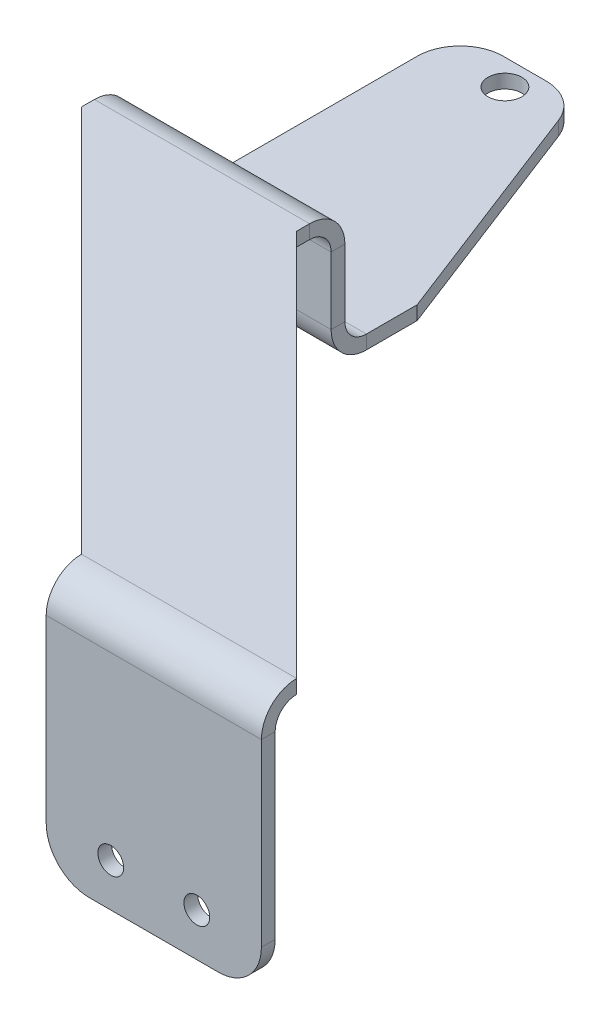
ISO-10303-21;
HEADER;
FILE_DESCRIPTION(('STEP AP214'),'2;1');
FILE_NAME('part.step','',(''),(''),'','','');
FILE_SCHEMA(('AUTOMOTIVE_DESIGN { 1 0 10303 214 1 1 1 1 }'));
ENDSEC;
DATA;
#1=APPLICATION_CONTEXT('core data for automotive mechanical design processes');
#2=APPLICATION_PROTOCOL_DEFINITION('international standard','automotive_design',2000,#1);
#3=PRODUCT_CONTEXT('',#1,'mechanical');
#4=PRODUCT('Part','Part','',(#3));
#5=PRODUCT_RELATED_PRODUCT_CATEGORY('part','',(#4));
#6=PRODUCT_DEFINITION_FORMATION('','',#4);
#7=PRODUCT_DEFINITION_CONTEXT('part definition',#1,'design');
#8=PRODUCT_DEFINITION('design','',#6,#7);
#9=PRODUCT_DEFINITION_SHAPE('','',#8);
#10=(LENGTH_UNIT() NAMED_UNIT(*) SI_UNIT(.MILLI.,.METRE.));
#11=(NAMED_UNIT(*) PLANE_ANGLE_UNIT() SI_UNIT($,.RADIAN.));
#12=(NAMED_UNIT(*) SI_UNIT($,.STERADIAN.) SOLID_ANGLE_UNIT());
#13=UNCERTAINTY_MEASURE_WITH_UNIT(LENGTH_MEASURE(1.E-05),#10,'distance_accuracy_value','');
#14=(GEOMETRIC_REPRESENTATION_CONTEXT(3) GLOBAL_UNCERTAINTY_ASSIGNED_CONTEXT((#13)) GLOBAL_UNIT_ASSIGNED_CONTEXT((#10,
#11,#12)) REPRESENTATION_CONTEXT('',''));
#15=CARTESIAN_POINT('',(0.,0.,0.));
#16=DIRECTION('',(0.,0.,1.));
#17=DIRECTION('',(1.,0.,0.));
#18=AXIS2_PLACEMENT_3D('',#15,#16,#17);
#19=CARTESIAN_POINT('',(-25.2971659919028,18.288,7.66113360323893));
#20=DIRECTION('',(-1.,0.,0.));
#21=DIRECTION('',(0.,0.,1.));
#22=AXIS2_PLACEMENT_3D('',#19,#20,#21);
#23=PLANE('',#22);
#24=DIRECTION('',(0.,1.,0.));
#25=VECTOR('',#24,1.);
#26=CARTESIAN_POINT('',(-25.2971659919028,18.288,7.66113360323893));
#27=LINE('',#26,#25);
#28=CARTESIAN_POINT('',(-25.2971659919028,3.17499999999997,7.66113360323888));
#29=VERTEX_POINT('',#28);
#30=CARTESIAN_POINT('',(-25.2971659919028,13.081,7.66113360323892));
#31=VERTEX_POINT('',#30);
#32=EDGE_CURVE('E381',#29,#31,#27,.T.);
#33=ORIENTED_EDGE('',*,*,#32,.T.);
#34=DIRECTION('',(0.,0.,-1.));
#35=VECTOR('',#34,1.);
#36=CARTESIAN_POINT('',(-25.2971659919028,13.081,7.66113360323892));
#37=LINE('',#36,#35);
#38=CARTESIAN_POINT('',(-25.2971659919028,13.081,5.62913360323892));
#39=VERTEX_POINT('',#38);
#40=EDGE_CURVE('E362',#31,#39,#37,.T.);
#41=ORIENTED_EDGE('',*,*,#40,.T.);
#42=DIRECTION('',(0.,-1.,0.));
#43=VECTOR('',#42,1.);
#44=CARTESIAN_POINT('',(-25.2971659919028,0.,5.62913360323887));
#45=LINE('',#44,#43);
#46=CARTESIAN_POINT('',(-25.2971659919028,3.17499999999998,5.62913360323888));
#47=VERTEX_POINT('',#46);
#48=EDGE_CURVE('E386',#47,#39,#45,.F.);
#49=ORIENTED_EDGE('',*,*,#48,.F.);
#50=DIRECTION('',(0.,0.,1.));
#51=VECTOR('',#50,1.);
#52=CARTESIAN_POINT('',(-25.2971659919028,3.17499999999999,7.66113360323893));
#53=LINE('',#52,#51);
#54=EDGE_CURVE('E376',#47,#29,#53,.T.);
#55=ORIENTED_EDGE('',*,*,#54,.T.);
#56=EDGE_LOOP('',(#33,#41,#49,#55));
#57=FACE_BOUND('',#56,.T.);
#58=ADVANCED_FACE('F97',(#57),#23,.T.);
#59=CARTESIAN_POINT('',(0.,0.,7.66113360323887));
#60=DIRECTION('',(0.,0.,1.));
#61=DIRECTION('',(0.,-1.,0.));
#62=AXIS2_PLACEMENT_3D('',#59,#60,#61);
#63=PLANE('',#62);
#64=DIRECTION('',(0.,-1.,0.));
#65=VECTOR('',#64,1.);
#66=CARTESIAN_POINT('',(6.45283400809717,0.,7.66113360323887));
#67=LINE('',#66,#65);
#68=CARTESIAN_POINT('',(6.45283400809717,13.081,7.66113360323891));
#69=VERTEX_POINT('',#68);
#70=CARTESIAN_POINT('',(6.45283400809717,3.17499999999999,7.66113360323888));
#71=VERTEX_POINT('',#70);
#72=EDGE_CURVE('E378',#69,#71,#67,.T.);
#73=ORIENTED_EDGE('',*,*,#72,.F.);
#74=DIRECTION('',(-1.,0.,0.));
#75=VECTOR('',#74,1.);
#76=CARTESIAN_POINT('',(-25.2971659919028,13.081,7.66113360323892));
#77=LINE('',#76,#75);
#78=EDGE_CURVE('E368',#31,#69,#77,.F.);
#79=ORIENTED_EDGE('',*,*,#78,.F.);
#80=ORIENTED_EDGE('',*,*,#32,.F.);
#81=DIRECTION('',(1.,0.,0.));
#82=VECTOR('',#81,1.);
#83=CARTESIAN_POINT('',(0.,3.17499999999999,7.66113360323888));
#84=LINE('',#83,#82);
#85=EDGE_CURVE('E389',#29,#71,#84,.T.);
#86=ORIENTED_EDGE('',*,*,#85,.T.);
#87=EDGE_LOOP('',(#73,#79,#80,#86));
#88=FACE_BOUND('',#87,.T.);
#89=ADVANCED_FACE('F528',(#88),#63,.T.);
#90=CARTESIAN_POINT('',(0.,0.,5.62913360323887));
#91=DIRECTION('',(0.,0.,1.));
#92=DIRECTION('',(0.,-1.,0.));
#93=AXIS2_PLACEMENT_3D('',#90,#91,#92);
#94=PLANE('',#93);
#95=DIRECTION('',(-1.,0.,0.));
#96=VECTOR('',#95,1.);
#97=CARTESIAN_POINT('',(-25.2971659919028,13.081,5.62913360323892));
#98=LINE('',#97,#96);
#99=CARTESIAN_POINT('',(6.45283400809717,13.081,5.62913360323892));
#100=VERTEX_POINT('',#99);
#101=EDGE_CURVE('E356',#39,#100,#98,.F.);
#102=ORIENTED_EDGE('',*,*,#101,.T.);
#103=DIRECTION('',(0.,1.,0.));
#104=VECTOR('',#103,1.);
#105=CARTESIAN_POINT('',(6.45283400809717,0.,5.62913360323887));
#106=LINE('',#105,#104);
#107=CARTESIAN_POINT('',(6.45283400809717,3.17499999999998,5.62913360323888));
#108=VERTEX_POINT('',#107);
#109=EDGE_CURVE('E384',#100,#108,#106,.F.);
#110=ORIENTED_EDGE('',*,*,#109,.T.);
#111=DIRECTION('',(-1.,0.,0.));
#112=VECTOR('',#111,1.);
#113=CARTESIAN_POINT('',(-25.2971659919028,3.17499999999999,5.62913360323888));
#114=LINE('',#113,#112);
#115=EDGE_CURVE('E395',#47,#108,#114,.F.);
#116=ORIENTED_EDGE('',*,*,#115,.F.);
#117=ORIENTED_EDGE('',*,*,#48,.T.);
#118=EDGE_LOOP('',(#102,#110,#116,#117));
#119=FACE_BOUND('',#118,.T.);
#120=ADVANCED_FACE('F616',(#119),#94,.F.);
#121=CARTESIAN_POINT('',(0.,-2.032,0.));
#122=DIRECTION('',(0.,1.,0.));
#123=DIRECTION('',(0.,0.,1.));
#124=AXIS2_PLACEMENT_3D('',#121,#122,#123);
#125=PLANE('',#124);
#126=CARTESIAN_POINT('',(-14.8971659919028,-2.032,-39.3288663967611));
#127=DIRECTION('',(0.,1.,0.));
#128=DIRECTION('',(0.,0.,1.));
#129=AXIS2_PLACEMENT_3D('',#126,#127,#128);
#130=CIRCLE('',#129,2.5);
#131=CARTESIAN_POINT('',(-14.8971659919028,-2.032,-36.8288663967611));
#132=VERTEX_POINT('',#131);
#133=EDGE_CURVE('E441',#132,#132,#130,.T.);
#134=ORIENTED_EDGE('',*,*,#133,.T.);
#135=EDGE_LOOP('',(#134));
#136=FACE_BOUND('',#135,.T.);
#137=CARTESIAN_POINT('',(-14.8971659919028,-2.032,-1.32886639676113));
#138=DIRECTION('',(0.,1.,0.));
#139=DIRECTION('',(0.,0.,1.));
#140=AXIS2_PLACEMENT_3D('',#137,#138,#139);
#141=CIRCLE('',#140,2.5);
#142=CARTESIAN_POINT('',(-14.8971659919028,-2.032,1.17113360323887));
#143=VERTEX_POINT('',#142);
#144=EDGE_CURVE('E435',#143,#143,#141,.T.);
#145=ORIENTED_EDGE('',*,*,#144,.T.);
#146=EDGE_LOOP('',(#145));
#147=FACE_BOUND('',#146,.T.);
#148=DIRECTION('',(-1.,0.,0.));
#149=VECTOR('',#148,1.);
#150=CARTESIAN_POINT('',(-25.2971659919028,-2.032,-43.1388663967611));
#151=LINE('',#150,#149);
#152=CARTESIAN_POINT('',(-12.6301202704523,-2.032,-43.1388663967611));
#153=VERTEX_POINT('',#152);
#154=CARTESIAN_POINT('',(-18.9471659919028,-2.032,-43.1388663967611));
#155=VERTEX_POINT('',#154);
#156=EDGE_CURVE('E447',#153,#155,#151,.T.);
#157=ORIENTED_EDGE('',*,*,#156,.F.);
#158=CARTESIAN_POINT('',(-12.6301202704523,-2.032,-36.7888663967611));
#159=DIRECTION('',(0.,1.,0.));
#160=DIRECTION('',(0.,0.,1.));
#161=AXIS2_PLACEMENT_3D('',#158,#159,#160);
#162=CIRCLE('',#161,6.35);
#163=CARTESIAN_POINT('',(-6.70734558879039,-2.032,-39.0786786314793));
#164=VERTEX_POINT('',#163);
#165=EDGE_CURVE('E105',#153,#164,#162,.F.);
#166=ORIENTED_EDGE('',*,*,#165,.T.);
#167=DIRECTION('',(0.360600351924129,0.,0.932720422308954));
#168=VECTOR('',#167,1.);
#169=CARTESIAN_POINT('',(7.30852399538076,-2.032,-2.82555872236201));
#170=LINE('',#169,#168);
#171=CARTESIAN_POINT('',(6.45283400809717,-2.032,-5.03886639676113));
#172=VERTEX_POINT('',#171);
#173=EDGE_CURVE('E430',#164,#172,#170,.T.);
#174=ORIENTED_EDGE('',*,*,#173,.T.);
#175=DIRECTION('',(0.,0.,1.));
#176=VECTOR('',#175,1.);
#177=CARTESIAN_POINT('',(6.45283400809717,-2.032,0.));
#178=LINE('',#177,#176);
#179=CARTESIAN_POINT('',(6.45283400809717,-2.03200000000001,2.45413360323888));
#180=VERTEX_POINT('',#179);
#181=EDGE_CURVE('E432',#172,#180,#178,.T.);
#182=ORIENTED_EDGE('',*,*,#181,.T.);
#183=DIRECTION('',(1.,0.,0.));
#184=VECTOR('',#183,1.);
#185=CARTESIAN_POINT('',(6.45283400809717,-2.03200000000001,2.45413360323888));
#186=LINE('',#185,#184);
#187=CARTESIAN_POINT('',(-25.2971659919028,-2.032,2.45413360323888));
#188=VERTEX_POINT('',#187);
#189=EDGE_CURVE('E400',#180,#188,#186,.F.);
#190=ORIENTED_EDGE('',*,*,#189,.T.);
#191=DIRECTION('',(0.,0.,1.));
#192=VECTOR('',#191,1.);
#193=CARTESIAN_POINT('',(-25.2971659919028,-2.032,-43.1388663967611));
#194=LINE('',#193,#192);
#195=CARTESIAN_POINT('',(-25.2971659919028,-2.032,-36.7888663967611));
#196=VERTEX_POINT('',#195);
#197=EDGE_CURVE('E449',#196,#188,#194,.T.);
#198=ORIENTED_EDGE('',*,*,#197,.F.);
#199=CARTESIAN_POINT('',(-18.9471659919028,-2.032,-36.7888663967611));
#200=DIRECTION('',(0.,1.,0.));
#201=DIRECTION('',(0.,0.,1.));
#202=AXIS2_PLACEMENT_3D('',#199,#200,#201);
#203=CIRCLE('',#202,6.35);
#204=EDGE_CURVE('E117',#196,#155,#203,.F.);
#205=ORIENTED_EDGE('',*,*,#204,.T.);
#206=EDGE_LOOP('',(#157,#166,#174,#182,#190,#198,#205));
#207=FACE_BOUND('',#206,.T.);
#208=ADVANCED_FACE('F492',(#136,#147,#207),#125,.F.);
#209=CARTESIAN_POINT('',(0.,0.,0.));
#210=DIRECTION('',(0.,1.,0.));
#211=DIRECTION('',(0.,0.,1.));
#212=AXIS2_PLACEMENT_3D('',#209,#210,#211);
#213=PLANE('',#212);
#214=CARTESIAN_POINT('',(-14.8971659919028,0.,-1.32886639676113));
#215=DIRECTION('',(0.,1.,0.));
#216=DIRECTION('',(0.,0.,1.));
#217=AXIS2_PLACEMENT_3D('',#214,#215,#216);
#218=CIRCLE('',#217,2.5);
#219=CARTESIAN_POINT('',(-14.8971659919028,0.,1.17113360323887));
#220=VERTEX_POINT('',#219);
#221=EDGE_CURVE('E434',#220,#220,#218,.T.);
#222=ORIENTED_EDGE('',*,*,#221,.F.);
#223=EDGE_LOOP('',(#222));
#224=FACE_BOUND('',#223,.T.);
#225=CARTESIAN_POINT('',(-14.8971659919028,0.,-39.3288663967611));
#226=DIRECTION('',(0.,1.,0.));
#227=DIRECTION('',(0.,0.,1.));
#228=AXIS2_PLACEMENT_3D('',#225,#226,#227);
#229=CIRCLE('',#228,2.5);
#230=CARTESIAN_POINT('',(-14.8971659919028,0.,-36.8288663967611));
#231=VERTEX_POINT('',#230);
#232=EDGE_CURVE('E438',#231,#231,#229,.T.);
#233=ORIENTED_EDGE('',*,*,#232,.F.);
#234=EDGE_LOOP('',(#233));
#235=FACE_BOUND('',#234,.T.);
#236=DIRECTION('',(0.360600351924129,0.,0.932720422308954));
#237=VECTOR('',#236,1.);
#238=CARTESIAN_POINT('',(6.45283400809717,0.,-5.03886639676113));
#239=LINE('',#238,#237);
#240=CARTESIAN_POINT('',(-6.7073455887904,0.,-39.0786786314793));
#241=VERTEX_POINT('',#240);
#242=CARTESIAN_POINT('',(6.45283400809717,0.,-5.03886639676113));
#243=VERTEX_POINT('',#242);
#244=EDGE_CURVE('E425',#241,#243,#239,.T.);
#245=ORIENTED_EDGE('',*,*,#244,.F.);
#246=CARTESIAN_POINT('',(-12.6301202704523,0.,-36.7888663967611));
#247=DIRECTION('',(0.,1.,0.));
#248=DIRECTION('',(0.,0.,1.));
#249=AXIS2_PLACEMENT_3D('',#246,#247,#248);
#250=CIRCLE('',#249,6.35);
#251=CARTESIAN_POINT('',(-12.6301202704523,0.,-43.1388663967611));
#252=VERTEX_POINT('',#251);
#253=EDGE_CURVE('E483',#241,#252,#250,.T.);
#254=ORIENTED_EDGE('',*,*,#253,.T.);
#255=DIRECTION('',(-1.,0.,0.));
#256=VECTOR('',#255,1.);
#257=CARTESIAN_POINT('',(-25.2971659919028,0.,-43.1388663967611));
#258=LINE('',#257,#256);
#259=CARTESIAN_POINT('',(-18.9471659919028,0.,-43.1388663967611));
#260=VERTEX_POINT('',#259);
#261=EDGE_CURVE('E444',#252,#260,#258,.T.);
#262=ORIENTED_EDGE('',*,*,#261,.T.);
#263=CARTESIAN_POINT('',(-18.9471659919028,0.,-36.7888663967611));
#264=DIRECTION('',(0.,1.,0.));
#265=DIRECTION('',(0.,0.,1.));
#266=AXIS2_PLACEMENT_3D('',#263,#264,#265);
#267=CIRCLE('',#266,6.35);
#268=CARTESIAN_POINT('',(-25.2971659919028,0.,-36.7888663967611));
#269=VERTEX_POINT('',#268);
#270=EDGE_CURVE('E481',#260,#269,#267,.T.);
#271=ORIENTED_EDGE('',*,*,#270,.T.);
#272=DIRECTION('',(0.,0.,1.));
#273=VECTOR('',#272,1.);
#274=CARTESIAN_POINT('',(-25.2971659919028,0.,-43.1388663967611));
#275=LINE('',#274,#273);
#276=CARTESIAN_POINT('',(-25.2971659919028,0.,2.45413360323888));
#277=VERTEX_POINT('',#276);
#278=EDGE_CURVE('E450',#269,#277,#275,.T.);
#279=ORIENTED_EDGE('',*,*,#278,.T.);
#280=DIRECTION('',(1.,0.,0.));
#281=VECTOR('',#280,1.);
#282=CARTESIAN_POINT('',(6.45283400809717,0.,2.45413360323888));
#283=LINE('',#282,#281);
#284=CARTESIAN_POINT('',(6.45283400809717,0.,2.45413360323888));
#285=VERTEX_POINT('',#284);
#286=EDGE_CURVE('E413',#285,#277,#283,.F.);
#287=ORIENTED_EDGE('',*,*,#286,.F.);
#288=DIRECTION('',(0.,0.,1.));
#289=VECTOR('',#288,1.);
#290=CARTESIAN_POINT('',(6.45283400809717,0.,-5.03886639676113));
#291=LINE('',#290,#289);
#292=EDGE_CURVE('E421',#243,#285,#291,.T.);
#293=ORIENTED_EDGE('',*,*,#292,.F.);
#294=EDGE_LOOP('',(#245,#254,#262,#271,#279,#287,#293));
#295=FACE_BOUND('',#294,.T.);
#296=ADVANCED_FACE('F504',(#224,#235,#295),#213,.T.);
#297=CARTESIAN_POINT('',(6.45283400809717,-2.54,-5.03886639676113));
#298=DIRECTION('',(-1.,0.,0.));
#299=DIRECTION('',(0.,0.,1.));
#300=AXIS2_PLACEMENT_3D('',#297,#298,#299);
#301=PLANE('',#300);
#302=DIRECTION('',(0.,-1.,0.));
#303=VECTOR('',#302,1.);
#304=CARTESIAN_POINT('',(6.45283400809717,0.,2.45413360323888));
#305=LINE('',#304,#303);
#306=EDGE_CURVE('E407',#285,#180,#305,.T.);
#307=ORIENTED_EDGE('',*,*,#306,.T.);
#308=ORIENTED_EDGE('',*,*,#181,.F.);
#309=DIRECTION('',(0.,1.,0.));
#310=VECTOR('',#309,1.);
#311=CARTESIAN_POINT('',(6.45283400809717,-2.54,-5.03886639676113));
#312=LINE('',#311,#310);
#313=EDGE_CURVE('E427',#172,#243,#312,.T.);
#314=ORIENTED_EDGE('',*,*,#313,.T.);
#315=ORIENTED_EDGE('',*,*,#292,.T.);
#316=EDGE_LOOP('',(#307,#308,#314,#315));
#317=FACE_BOUND('',#316,.T.);
#318=ADVANCED_FACE('F637',(#317),#301,.F.);
#319=CARTESIAN_POINT('',(-25.2971659919028,-2.032,-43.1388663967611));
#320=DIRECTION('',(-1.,0.,0.));
#321=DIRECTION('',(0.,0.,1.));
#322=AXIS2_PLACEMENT_3D('',#319,#320,#321);
#323=PLANE('',#322);
#324=ORIENTED_EDGE('',*,*,#278,.F.);
#325=DIRECTION('',(0.,1.,0.));
#326=VECTOR('',#325,1.);
#327=CARTESIAN_POINT('',(-25.2971659919028,-2.032,-36.7888663967611));
#328=LINE('',#327,#326);
#329=EDGE_CURVE('E13',#269,#196,#328,.F.);
#330=ORIENTED_EDGE('',*,*,#329,.T.);
#331=ORIENTED_EDGE('',*,*,#197,.T.);
#332=DIRECTION('',(0.,-1.,0.));
#333=VECTOR('',#332,1.);
#334=CARTESIAN_POINT('',(-25.2971659919028,0.,2.45413360323888));
#335=LINE('',#334,#333);
#336=EDGE_CURVE('E418',#277,#188,#335,.T.);
#337=ORIENTED_EDGE('',*,*,#336,.F.);
#338=EDGE_LOOP('',(#324,#330,#331,#337));
#339=FACE_BOUND('',#338,.T.);
#340=ADVANCED_FACE('F512',(#339),#323,.T.);
#341=CARTESIAN_POINT('',(-25.2971659919028,-2.032,-43.1388663967611));
#342=DIRECTION('',(0.,0.,-1.));
#343=DIRECTION('',(-1.,0.,0.));
#344=AXIS2_PLACEMENT_3D('',#341,#342,#343);
#345=PLANE('',#344);
#346=ORIENTED_EDGE('',*,*,#261,.F.);
#347=DIRECTION('',(0.,1.,0.));
#348=VECTOR('',#347,1.);
#349=CARTESIAN_POINT('',(-12.6301202704523,-2.032,-43.1388663967611));
#350=LINE('',#349,#348);
#351=EDGE_CURVE('E488',#252,#153,#350,.F.);
#352=ORIENTED_EDGE('',*,*,#351,.T.);
#353=ORIENTED_EDGE('',*,*,#156,.T.);
#354=DIRECTION('',(0.,1.,0.));
#355=VECTOR('',#354,1.);
#356=CARTESIAN_POINT('',(-18.9471659919028,-2.032,-43.1388663967611));
#357=LINE('',#356,#355);
#358=EDGE_CURVE('E485',#155,#260,#357,.T.);
#359=ORIENTED_EDGE('',*,*,#358,.T.);
#360=EDGE_LOOP('',(#346,#352,#353,#359));
#361=FACE_BOUND('',#360,.T.);
#362=ADVANCED_FACE('F507',(#361),#345,.T.);
#363=CARTESIAN_POINT('',(-14.8971659919028,-2.032,-39.3288663967611));
#364=DIRECTION('',(0.,1.,0.));
#365=DIRECTION('',(0.,0.,1.));
#366=AXIS2_PLACEMENT_3D('',#363,#364,#365);
#367=CYLINDRICAL_SURFACE('',#366,2.5);
#368=ORIENTED_EDGE('',*,*,#133,.F.);
#369=EDGE_LOOP('',(#368));
#370=FACE_BOUND('',#369,.T.);
#371=ORIENTED_EDGE('',*,*,#232,.T.);
#372=EDGE_LOOP('',(#371));
#373=FACE_BOUND('',#372,.T.);
#374=ADVANCED_FACE('F643',(#370,#373),#367,.F.);
#375=CARTESIAN_POINT('',(-14.8971659919028,-2.032,-1.32886639676113));
#376=DIRECTION('',(0.,1.,0.));
#377=DIRECTION('',(0.,0.,1.));
#378=AXIS2_PLACEMENT_3D('',#375,#376,#377);
#379=CYLINDRICAL_SURFACE('',#378,2.5);
#380=ORIENTED_EDGE('',*,*,#144,.F.);
#381=EDGE_LOOP('',(#380));
#382=FACE_BOUND('',#381,.T.);
#383=ORIENTED_EDGE('',*,*,#221,.T.);
#384=EDGE_LOOP('',(#383));
#385=FACE_BOUND('',#384,.T.);
#386=ADVANCED_FACE('F636',(#382,#385),#379,.F.);
#387=CARTESIAN_POINT('',(6.45283400809717,-2.54,-5.03886639676113));
#388=DIRECTION('',(-0.932720422308954,0.,0.360600351924129));
#389=DIRECTION('',(0.360600351924129,0.,0.932720422308954));
#390=AXIS2_PLACEMENT_3D('',#387,#388,#389);
#391=PLANE('',#390);
#392=ORIENTED_EDGE('',*,*,#173,.F.);
#393=DIRECTION('',(0.,1.,0.));
#394=VECTOR('',#393,1.);
#395=CARTESIAN_POINT('',(-6.70734558879039,0.,-39.0786786314793));
#396=LINE('',#395,#394);
#397=EDGE_CURVE('E478',#164,#241,#396,.T.);
#398=ORIENTED_EDGE('',*,*,#397,.T.);
#399=ORIENTED_EDGE('',*,*,#244,.T.);
#400=ORIENTED_EDGE('',*,*,#313,.F.);
#401=EDGE_LOOP('',(#392,#398,#399,#400));
#402=FACE_BOUND('',#401,.T.);
#403=ADVANCED_FACE('F499',(#402),#391,.F.);
#404=CARTESIAN_POINT('',(-25.2971659919028,3.17499999999999,2.45413360323888));
#405=DIRECTION('',(-1.,0.,0.));
#406=DIRECTION('',(0.,0.,1.));
#407=AXIS2_PLACEMENT_3D('',#404,#405,#406);
#408=PLANE('',#407);
#409=ORIENTED_EDGE('',*,*,#54,.F.);
#410=CARTESIAN_POINT('',(-25.2971659919028,3.17499999999999,2.45413360323888));
#411=DIRECTION('',(1.,0.,0.));
#412=DIRECTION('',(0.,0.,-1.));
#413=AXIS2_PLACEMENT_3D('',#410,#411,#412);
#414=CIRCLE('',#413,3.175);
#415=EDGE_CURVE('E410',#277,#47,#414,.F.);
#416=ORIENTED_EDGE('',*,*,#415,.F.);
#417=ORIENTED_EDGE('',*,*,#336,.T.);
#418=CARTESIAN_POINT('',(-25.2971659919028,3.17499999999999,2.45413360323888));
#419=DIRECTION('',(1.,0.,0.));
#420=DIRECTION('',(0.,0.,-1.));
#421=AXIS2_PLACEMENT_3D('',#418,#419,#420);
#422=CIRCLE('',#421,5.207);
#423=EDGE_CURVE('E403',#188,#29,#422,.F.);
#424=ORIENTED_EDGE('',*,*,#423,.T.);
#425=EDGE_LOOP('',(#409,#416,#417,#424));
#426=FACE_BOUND('',#425,.T.);
#427=ADVANCED_FACE('F521',(#426),#408,.T.);
#428=CARTESIAN_POINT('',(6.45283400809717,3.17499999999999,2.45413360323888));
#429=DIRECTION('',(-1.,0.,0.));
#430=DIRECTION('',(0.,0.,1.));
#431=AXIS2_PLACEMENT_3D('',#428,#429,#430);
#432=PLANE('',#431);
#433=CARTESIAN_POINT('',(6.45283400809717,3.17499999999999,2.45413360323888));
#434=DIRECTION('',(1.,0.,0.));
#435=DIRECTION('',(0.,0.,-1.));
#436=AXIS2_PLACEMENT_3D('',#433,#434,#435);
#437=CIRCLE('',#436,3.175);
#438=EDGE_CURVE('E380',#108,#285,#437,.T.);
#439=ORIENTED_EDGE('',*,*,#438,.F.);
#440=DIRECTION('',(0.,0.,1.));
#441=VECTOR('',#440,1.);
#442=CARTESIAN_POINT('',(6.45283400809717,3.17499999999999,5.62913360323888));
#443=LINE('',#442,#441);
#444=EDGE_CURVE('E392',#108,#71,#443,.T.);
#445=ORIENTED_EDGE('',*,*,#444,.T.);
#446=CARTESIAN_POINT('',(6.45283400809717,3.17499999999999,2.45413360323888));
#447=DIRECTION('',(1.,0.,0.));
#448=DIRECTION('',(0.,0.,-1.));
#449=AXIS2_PLACEMENT_3D('',#446,#447,#448);
#450=CIRCLE('',#449,5.207);
#451=EDGE_CURVE('E404',#71,#180,#450,.T.);
#452=ORIENTED_EDGE('',*,*,#451,.T.);
#453=ORIENTED_EDGE('',*,*,#306,.F.);
#454=EDGE_LOOP('',(#439,#445,#452,#453));
#455=FACE_BOUND('',#454,.T.);
#456=ADVANCED_FACE('F625',(#455),#432,.F.);
#457=CARTESIAN_POINT('',(6.45283400809717,3.17499999999999,2.45413360323888));
#458=DIRECTION('',(1.,0.,0.));
#459=DIRECTION('',(0.,0.,1.));
#460=AXIS2_PLACEMENT_3D('',#457,#458,#459);
#461=CYLINDRICAL_SURFACE('',#460,5.207);
#462=ORIENTED_EDGE('',*,*,#189,.F.);
#463=ORIENTED_EDGE('',*,*,#451,.F.);
#464=ORIENTED_EDGE('',*,*,#85,.F.);
#465=ORIENTED_EDGE('',*,*,#423,.F.);
#466=EDGE_LOOP('',(#462,#463,#464,#465));
#467=FACE_BOUND('',#466,.T.);
#468=ADVANCED_FACE('F622',(#467),#461,.T.);
#469=CARTESIAN_POINT('',(6.45283400809717,3.17499999999999,2.45413360323888));
#470=DIRECTION('',(1.,0.,0.));
#471=DIRECTION('',(0.,0.,1.));
#472=AXIS2_PLACEMENT_3D('',#469,#470,#471);
#473=CYLINDRICAL_SURFACE('',#472,3.175);
#474=ORIENTED_EDGE('',*,*,#286,.T.);
#475=ORIENTED_EDGE('',*,*,#415,.T.);
#476=ORIENTED_EDGE('',*,*,#115,.T.);
#477=ORIENTED_EDGE('',*,*,#438,.T.);
#478=EDGE_LOOP('',(#474,#475,#476,#477));
#479=FACE_BOUND('',#478,.T.);
#480=ADVANCED_FACE('F517',(#479),#473,.F.);
#481=CARTESIAN_POINT('',(6.45283400809717,0.,7.66113360323887));
#482=DIRECTION('',(1.,0.,0.));
#483=DIRECTION('',(0.,1.,0.));
#484=AXIS2_PLACEMENT_3D('',#481,#482,#483);
#485=PLANE('',#484);
#486=DIRECTION('',(0.,0.,-1.));
#487=VECTOR('',#486,1.);
#488=CARTESIAN_POINT('',(6.45283400809717,13.081,7.66113360323892));
#489=LINE('',#488,#487);
#490=EDGE_CURVE('E373',#69,#100,#489,.T.);
#491=ORIENTED_EDGE('',*,*,#490,.F.);
#492=ORIENTED_EDGE('',*,*,#72,.T.);
#493=ORIENTED_EDGE('',*,*,#444,.F.);
#494=ORIENTED_EDGE('',*,*,#109,.F.);
#495=EDGE_LOOP('',(#491,#492,#493,#494));
#496=FACE_BOUND('',#495,.T.);
#497=ADVANCED_FACE('F620',(#496),#485,.T.);
#498=CARTESIAN_POINT('',(6.45283400809717,13.081,10.8361336032389));
#499=DIRECTION('',(1.,0.,0.));
#500=DIRECTION('',(0.,1.,0.));
#501=AXIS2_PLACEMENT_3D('',#498,#499,#500);
#502=PLANE('',#501);
#503=DIRECTION('',(0.,-1.,0.));
#504=VECTOR('',#503,1.);
#505=CARTESIAN_POINT('',(6.45283400809717,18.288,10.8361336032389));
#506=LINE('',#505,#504);
#507=CARTESIAN_POINT('',(6.45283400809717,16.256,10.8361336032389));
#508=VERTEX_POINT('',#507);
#509=CARTESIAN_POINT('',(6.45283400809717,18.288,10.8361336032389));
#510=VERTEX_POINT('',#509);
#511=EDGE_CURVE('E329',#508,#510,#506,.F.);
#512=ORIENTED_EDGE('',*,*,#511,.F.);
#513=CARTESIAN_POINT('',(6.45283400809717,13.081,10.8361336032389));
#514=DIRECTION('',(-1.,0.,0.));
#515=DIRECTION('',(0.,-1.,0.));
#516=AXIS2_PLACEMENT_3D('',#513,#514,#515);
#517=CIRCLE('',#516,3.175);
#518=EDGE_CURVE('E365',#69,#508,#517,.F.);
#519=ORIENTED_EDGE('',*,*,#518,.F.);
#520=ORIENTED_EDGE('',*,*,#490,.T.);
#521=CARTESIAN_POINT('',(6.45283400809717,13.081,10.8361336032389));
#522=DIRECTION('',(-1.,0.,0.));
#523=DIRECTION('',(0.,-1.,0.));
#524=AXIS2_PLACEMENT_3D('',#521,#522,#523);
#525=CIRCLE('',#524,5.207);
#526=EDGE_CURVE('E358',#100,#510,#525,.F.);
#527=ORIENTED_EDGE('',*,*,#526,.T.);
#528=EDGE_LOOP('',(#512,#519,#520,#527));
#529=FACE_BOUND('',#528,.T.);
#530=ADVANCED_FACE('F535',(#529),#502,.T.);
#531=CARTESIAN_POINT('',(-25.2971659919028,13.081,10.8361336032389));
#532=DIRECTION('',(1.,0.,0.));
#533=DIRECTION('',(0.,1.,0.));
#534=AXIS2_PLACEMENT_3D('',#531,#532,#533);
#535=PLANE('',#534);
#536=CARTESIAN_POINT('',(-25.2971659919028,13.081,10.8361336032389));
#537=DIRECTION('',(-1.,0.,0.));
#538=DIRECTION('',(0.,-1.,0.));
#539=AXIS2_PLACEMENT_3D('',#536,#537,#538);
#540=CIRCLE('',#539,3.175);
#541=CARTESIAN_POINT('',(-25.2971659919028,16.256,10.8361336032389));
#542=VERTEX_POINT('',#541);
#543=EDGE_CURVE('E334',#542,#31,#540,.T.);
#544=ORIENTED_EDGE('',*,*,#543,.F.);
#545=DIRECTION('',(0.,-1.,0.));
#546=VECTOR('',#545,1.);
#547=CARTESIAN_POINT('',(-25.2971659919028,16.256,10.8361336032389));
#548=LINE('',#547,#546);
#549=CARTESIAN_POINT('',(-25.2971659919028,18.288,10.8361336032389));
#550=VERTEX_POINT('',#549);
#551=EDGE_CURVE('E349',#542,#550,#548,.F.);
#552=ORIENTED_EDGE('',*,*,#551,.T.);
#553=CARTESIAN_POINT('',(-25.2971659919028,13.081,10.8361336032389));
#554=DIRECTION('',(-1.,0.,0.));
#555=DIRECTION('',(0.,-1.,0.));
#556=AXIS2_PLACEMENT_3D('',#553,#554,#555);
#557=CIRCLE('',#556,5.207);
#558=EDGE_CURVE('E359',#550,#39,#557,.T.);
#559=ORIENTED_EDGE('',*,*,#558,.T.);
#560=ORIENTED_EDGE('',*,*,#40,.F.);
#561=EDGE_LOOP('',(#544,#552,#559,#560));
#562=FACE_BOUND('',#561,.T.);
#563=ADVANCED_FACE('F557',(#562),#535,.F.);
#564=CARTESIAN_POINT('',(-25.2971659919028,13.081,10.8361336032389));
#565=DIRECTION('',(-1.,0.,0.));
#566=DIRECTION('',(0.,1.,0.));
#567=AXIS2_PLACEMENT_3D('',#564,#565,#566);
#568=CYLINDRICAL_SURFACE('',#567,5.207);
#569=ORIENTED_EDGE('',*,*,#101,.F.);
#570=ORIENTED_EDGE('',*,*,#558,.F.);
#571=DIRECTION('',(-1.,0.,0.));
#572=VECTOR('',#571,1.);
#573=CARTESIAN_POINT('',(6.45283400809717,18.288,10.8361336032389));
#574=LINE('',#573,#572);
#575=EDGE_CURVE('E347',#550,#510,#574,.F.);
#576=ORIENTED_EDGE('',*,*,#575,.T.);
#577=ORIENTED_EDGE('',*,*,#526,.F.);
#578=EDGE_LOOP('',(#569,#570,#576,#577));
#579=FACE_BOUND('',#578,.T.);
#580=ADVANCED_FACE('F875',(#579),#568,.T.);
#581=CARTESIAN_POINT('',(-25.2971659919028,13.081,10.8361336032389));
#582=DIRECTION('',(-1.,0.,0.));
#583=DIRECTION('',(0.,1.,0.));
#584=AXIS2_PLACEMENT_3D('',#581,#582,#583);
#585=CYLINDRICAL_SURFACE('',#584,3.175);
#586=ORIENTED_EDGE('',*,*,#78,.T.);
#587=ORIENTED_EDGE('',*,*,#518,.T.);
#588=DIRECTION('',(-1.,0.,0.));
#589=VECTOR('',#588,1.);
#590=CARTESIAN_POINT('',(6.45283400809717,16.256,10.8361336032389));
#591=LINE('',#590,#589);
#592=EDGE_CURVE('E352',#508,#542,#591,.T.);
#593=ORIENTED_EDGE('',*,*,#592,.T.);
#594=ORIENTED_EDGE('',*,*,#543,.T.);
#595=EDGE_LOOP('',(#586,#587,#593,#594));
#596=FACE_BOUND('',#595,.T.);
#597=ADVANCED_FACE('F531',(#596),#585,.F.);
#598=CARTESIAN_POINT('',(-25.2971659919028,18.288,12.7411336032389));
#599=DIRECTION('',(1.,0.,0.));
#600=DIRECTION('',(0.,0.,-1.));
#601=AXIS2_PLACEMENT_3D('',#598,#599,#600);
#602=PLANE('',#601);
#603=ORIENTED_EDGE('',*,*,#551,.F.);
#604=DIRECTION('',(0.,0.,-1.));
#605=VECTOR('',#604,1.);
#606=CARTESIAN_POINT('',(-25.2971659919028,16.256,12.7411336032389));
#607=LINE('',#606,#605);
#608=CARTESIAN_POINT('',(-25.2971659919028,16.256,12.7411336032389));
#609=VERTEX_POINT('',#608);
#610=EDGE_CURVE('E345',#542,#609,#607,.F.);
#611=ORIENTED_EDGE('',*,*,#610,.T.);
#612=DIRECTION('',(0.,-1.,0.));
#613=VECTOR('',#612,1.);
#614=CARTESIAN_POINT('',(-25.2971659919028,18.288,12.7411336032389));
#615=LINE('',#614,#613);
#616=CARTESIAN_POINT('',(-25.2971659919028,18.288,12.7411336032389));
#617=VERTEX_POINT('',#616);
#618=EDGE_CURVE('E331',#617,#609,#615,.T.);
#619=ORIENTED_EDGE('',*,*,#618,.F.);
#620=DIRECTION('',(0.,0.,1.));
#621=VECTOR('',#620,1.);
#622=CARTESIAN_POINT('',(-25.2971659919028,18.288,0.));
#623=LINE('',#622,#621);
#624=EDGE_CURVE('E340',#550,#617,#623,.T.);
#625=ORIENTED_EDGE('',*,*,#624,.F.);
#626=EDGE_LOOP('',(#603,#611,#619,#625));
#627=FACE_BOUND('',#626,.T.);
#628=ADVANCED_FACE('F559',(#627),#602,.F.);
#629=CARTESIAN_POINT('',(6.45283400809717,18.288,7.66113360323893));
#630=DIRECTION('',(-1.,0.,0.));
#631=DIRECTION('',(0.,-1.,0.));
#632=AXIS2_PLACEMENT_3D('',#629,#630,#631);
#633=PLANE('',#632);
#634=ORIENTED_EDGE('',*,*,#511,.T.);
#635=DIRECTION('',(0.,0.,-1.));
#636=VECTOR('',#635,1.);
#637=CARTESIAN_POINT('',(6.45283400809717,18.288,0.));
#638=LINE('',#637,#636);
#639=CARTESIAN_POINT('',(6.45283400809717,18.288,12.7411336032389));
#640=VERTEX_POINT('',#639);
#641=EDGE_CURVE('E337',#640,#510,#638,.T.);
#642=ORIENTED_EDGE('',*,*,#641,.F.);
#643=DIRECTION('',(0.,-1.,0.));
#644=VECTOR('',#643,1.);
#645=CARTESIAN_POINT('',(6.45283400809717,18.288,12.7411336032389));
#646=LINE('',#645,#644);
#647=CARTESIAN_POINT('',(6.45283400809717,16.256,12.7411336032389));
#648=VERTEX_POINT('',#647);
#649=EDGE_CURVE('E335',#640,#648,#646,.T.);
#650=ORIENTED_EDGE('',*,*,#649,.T.);
#651=DIRECTION('',(0.,0.,1.));
#652=VECTOR('',#651,1.);
#653=CARTESIAN_POINT('',(6.45283400809717,16.256,7.66113360323893));
#654=LINE('',#653,#652);
#655=EDGE_CURVE('E342',#648,#508,#654,.F.);
#656=ORIENTED_EDGE('',*,*,#655,.T.);
#657=EDGE_LOOP('',(#634,#642,#650,#656));
#658=FACE_BOUND('',#657,.T.);
#659=ADVANCED_FACE('F538',(#658),#633,.F.);
#660=CARTESIAN_POINT('',(0.,18.288,0.));
#661=DIRECTION('',(0.,-1.,0.));
#662=DIRECTION('',(0.,0.,-1.));
#663=AXIS2_PLACEMENT_3D('',#660,#661,#662);
#664=PLANE('',#663);
#665=ORIENTED_EDGE('',*,*,#575,.F.);
#666=ORIENTED_EDGE('',*,*,#624,.T.);
#667=DIRECTION('',(0.707106781186547,0.,0.707106781186548));
#668=VECTOR('',#667,1.);
#669=CARTESIAN_POINT('',(-25.2971659919028,18.288,12.7411336032389));
#670=LINE('',#669,#668);
#671=CARTESIAN_POINT('',(31.8528340080972,18.288,69.8911336032389));
#672=VERTEX_POINT('',#671);
#673=EDGE_CURVE('E306',#617,#672,#670,.T.);
#674=ORIENTED_EDGE('',*,*,#673,.T.);
#675=DIRECTION('',(1.,0.,0.));
#676=VECTOR('',#675,1.);
#677=CARTESIAN_POINT('',(31.8528340080972,18.288,69.8911336032389));
#678=LINE('',#677,#676);
#679=CARTESIAN_POINT('',(63.6028340080972,18.288,69.8911336032389));
#680=VERTEX_POINT('',#679);
#681=EDGE_CURVE('E259',#672,#680,#678,.T.);
#682=ORIENTED_EDGE('',*,*,#681,.T.);
#683=DIRECTION('',(-0.707106781186547,0.,-0.707106781186548));
#684=VECTOR('',#683,1.);
#685=CARTESIAN_POINT('',(6.45283400809717,18.288,12.7411336032389));
#686=LINE('',#685,#684);
#687=EDGE_CURVE('E315',#680,#640,#686,.T.);
#688=ORIENTED_EDGE('',*,*,#687,.T.);
#689=ORIENTED_EDGE('',*,*,#641,.T.);
#690=EDGE_LOOP('',(#665,#666,#674,#682,#688,#689));
#691=FACE_BOUND('',#690,.T.);
#692=ADVANCED_FACE('F543',(#691),#664,.F.);
#693=CARTESIAN_POINT('',(0.,16.256,0.));
#694=DIRECTION('',(0.,-1.,0.));
#695=DIRECTION('',(0.,0.,-1.));
#696=AXIS2_PLACEMENT_3D('',#693,#694,#695);
#697=PLANE('',#696);
#698=ORIENTED_EDGE('',*,*,#610,.F.);
#699=ORIENTED_EDGE('',*,*,#592,.F.);
#700=ORIENTED_EDGE('',*,*,#655,.F.);
#701=DIRECTION('',(-0.707106781186547,0.,-0.707106781186548));
#702=VECTOR('',#701,1.);
#703=CARTESIAN_POINT('',(6.45283400809717,16.256,12.7411336032389));
#704=LINE('',#703,#702);
#705=CARTESIAN_POINT('',(63.6028340080971,16.256,69.8911336032389));
#706=VERTEX_POINT('',#705);
#707=EDGE_CURVE('E317',#706,#648,#704,.T.);
#708=ORIENTED_EDGE('',*,*,#707,.F.);
#709=DIRECTION('',(1.,0.,0.));
#710=VECTOR('',#709,1.);
#711=CARTESIAN_POINT('',(31.8528340080972,16.256,69.8911336032389));
#712=LINE('',#711,#710);
#713=CARTESIAN_POINT('',(31.8528340080972,16.256,69.8911336032389));
#714=VERTEX_POINT('',#713);
#715=EDGE_CURVE('E314',#714,#706,#712,.T.);
#716=ORIENTED_EDGE('',*,*,#715,.F.);
#717=DIRECTION('',(0.707106781186547,0.,0.707106781186548));
#718=VECTOR('',#717,1.);
#719=CARTESIAN_POINT('',(-25.2971659919028,16.256,12.7411336032389));
#720=LINE('',#719,#718);
#721=EDGE_CURVE('E311',#609,#714,#720,.T.);
#722=ORIENTED_EDGE('',*,*,#721,.F.);
#723=EDGE_LOOP('',(#698,#699,#700,#708,#716,#722));
#724=FACE_BOUND('',#723,.T.);
#725=ADVANCED_FACE('F552',(#724),#697,.T.);
#726=CARTESIAN_POINT('',(-25.2971659919028,16.256,12.7411336032389));
#727=DIRECTION('',(-0.707106781186548,0.,0.707106781186547));
#728=DIRECTION('',(0.707106781186547,0.,0.707106781186548));
#729=AXIS2_PLACEMENT_3D('',#726,#727,#728);
#730=PLANE('',#729);
#731=ORIENTED_EDGE('',*,*,#673,.F.);
#732=ORIENTED_EDGE('',*,*,#618,.T.);
#733=ORIENTED_EDGE('',*,*,#721,.T.);
#734=DIRECTION('',(0.,1.,0.));
#735=VECTOR('',#734,1.);
#736=CARTESIAN_POINT('',(31.8528340080972,16.256,69.8911336032389));
#737=LINE('',#736,#735);
#738=EDGE_CURVE('E320',#714,#672,#737,.T.);
#739=ORIENTED_EDGE('',*,*,#738,.T.);
#740=EDGE_LOOP('',(#731,#732,#733,#739));
#741=FACE_BOUND('',#740,.T.);
#742=ADVANCED_FACE('F563',(#741),#730,.T.);
#743=CARTESIAN_POINT('',(6.45283400809717,16.256,12.7411336032389));
#744=DIRECTION('',(0.707106781186548,0.,-0.707106781186547));
#745=DIRECTION('',(-0.707106781186547,0.,-0.707106781186548));
#746=AXIS2_PLACEMENT_3D('',#743,#744,#745);
#747=PLANE('',#746);
#748=ORIENTED_EDGE('',*,*,#687,.F.);
#749=DIRECTION('',(0.,1.,0.));
#750=VECTOR('',#749,1.);
#751=CARTESIAN_POINT('',(63.6028340080972,16.256,69.8911336032389));
#752=LINE('',#751,#750);
#753=EDGE_CURVE('E326',#706,#680,#752,.T.);
#754=ORIENTED_EDGE('',*,*,#753,.F.);
#755=ORIENTED_EDGE('',*,*,#707,.T.);
#756=ORIENTED_EDGE('',*,*,#649,.F.);
#757=EDGE_LOOP('',(#748,#754,#755,#756));
#758=FACE_BOUND('',#757,.T.);
#759=ADVANCED_FACE('F548',(#758),#747,.T.);
#760=CARTESIAN_POINT('',(63.6028340080971,13.081,69.8911336032389));
#761=DIRECTION('',(1.,0.,0.));
#762=DIRECTION('',(0.,0.,-1.));
#763=AXIS2_PLACEMENT_3D('',#760,#761,#762);
#764=PLANE('',#763);
#765=DIRECTION('',(0.,0.,-1.));
#766=VECTOR('',#765,1.);
#767=CARTESIAN_POINT('',(63.6028340080971,13.081,75.0981336032389));
#768=LINE('',#767,#766);
#769=CARTESIAN_POINT('',(63.6028340080971,13.081,73.0661336032389));
#770=VERTEX_POINT('',#769);
#771=CARTESIAN_POINT('',(63.6028340080971,13.081,75.0981336032389));
#772=VERTEX_POINT('',#771);
#773=EDGE_CURVE('E302',#770,#772,#768,.F.);
#774=ORIENTED_EDGE('',*,*,#773,.F.);
#775=CARTESIAN_POINT('',(63.6028340080971,13.081,69.8911336032389));
#776=DIRECTION('',(-1.,0.,0.));
#777=DIRECTION('',(0.,0.,1.));
#778=AXIS2_PLACEMENT_3D('',#775,#776,#777);
#779=CIRCLE('',#778,3.175);
#780=EDGE_CURVE('E263',#706,#770,#779,.F.);
#781=ORIENTED_EDGE('',*,*,#780,.F.);
#782=ORIENTED_EDGE('',*,*,#753,.T.);
#783=CARTESIAN_POINT('',(63.6028340080971,13.081,69.8911336032389));
#784=DIRECTION('',(-1.,0.,0.));
#785=DIRECTION('',(0.,0.,1.));
#786=AXIS2_PLACEMENT_3D('',#783,#784,#785);
#787=CIRCLE('',#786,5.207);
#788=EDGE_CURVE('E262',#680,#772,#787,.F.);
#789=ORIENTED_EDGE('',*,*,#788,.T.);
#790=EDGE_LOOP('',(#774,#781,#782,#789));
#791=FACE_BOUND('',#790,.T.);
#792=ADVANCED_FACE('F803',(#791),#764,.T.);
#793=CARTESIAN_POINT('',(31.8528340080972,13.081,69.8911336032389));
#794=DIRECTION('',(1.,0.,0.));
#795=DIRECTION('',(0.,0.,-1.));
#796=AXIS2_PLACEMENT_3D('',#793,#794,#795);
#797=PLANE('',#796);
#798=CARTESIAN_POINT('',(31.8528340080972,13.081,69.8911336032389));
#799=DIRECTION('',(-1.,0.,0.));
#800=DIRECTION('',(0.,0.,1.));
#801=AXIS2_PLACEMENT_3D('',#798,#799,#800);
#802=CIRCLE('',#801,3.175);
#803=CARTESIAN_POINT('',(31.8528340080972,13.081,73.0661336032389));
#804=VERTEX_POINT('',#803);
#805=EDGE_CURVE('E270',#804,#714,#802,.T.);
#806=ORIENTED_EDGE('',*,*,#805,.F.);
#807=DIRECTION('',(0.,0.,-1.));
#808=VECTOR('',#807,1.);
#809=CARTESIAN_POINT('',(31.8528340080972,13.081,73.0661336032389));
#810=LINE('',#809,#808);
#811=CARTESIAN_POINT('',(31.8528340080972,13.081,75.0981336032389));
#812=VERTEX_POINT('',#811);
#813=EDGE_CURVE('E267',#804,#812,#810,.F.);
#814=ORIENTED_EDGE('',*,*,#813,.T.);
#815=CARTESIAN_POINT('',(31.8528340080972,13.081,69.8911336032389));
#816=DIRECTION('',(-1.,0.,0.));
#817=DIRECTION('',(0.,0.,1.));
#818=AXIS2_PLACEMENT_3D('',#815,#816,#817);
#819=CIRCLE('',#818,5.207);
#820=EDGE_CURVE('E252',#812,#672,#819,.T.);
#821=ORIENTED_EDGE('',*,*,#820,.T.);
#822=ORIENTED_EDGE('',*,*,#738,.F.);
#823=EDGE_LOOP('',(#806,#814,#821,#822));
#824=FACE_BOUND('',#823,.T.);
#825=ADVANCED_FACE('F268',(#824),#797,.F.);
#826=CARTESIAN_POINT('',(31.8528340080972,13.081,69.8911336032389));
#827=DIRECTION('',(-1.,0.,0.));
#828=DIRECTION('',(0.,0.,1.));
#829=AXIS2_PLACEMENT_3D('',#826,#827,#828);
#830=CYLINDRICAL_SURFACE('',#829,5.207);
#831=ORIENTED_EDGE('',*,*,#681,.F.);
#832=ORIENTED_EDGE('',*,*,#820,.F.);
#833=DIRECTION('',(-1.,0.,0.));
#834=VECTOR('',#833,1.);
#835=CARTESIAN_POINT('',(63.6028340080971,13.081,75.0981336032389));
#836=LINE('',#835,#834);
#837=EDGE_CURVE('E256',#812,#772,#836,.F.);
#838=ORIENTED_EDGE('',*,*,#837,.T.);
#839=ORIENTED_EDGE('',*,*,#788,.F.);
#840=EDGE_LOOP('',(#831,#832,#838,#839));
#841=FACE_BOUND('',#840,.T.);
#842=ADVANCED_FACE('F254',(#841),#830,.T.);
#843=CARTESIAN_POINT('',(31.8528340080972,13.081,69.8911336032389));
#844=DIRECTION('',(-1.,0.,0.));
#845=DIRECTION('',(0.,0.,1.));
#846=AXIS2_PLACEMENT_3D('',#843,#844,#845);
#847=CYLINDRICAL_SURFACE('',#846,3.175);
#848=ORIENTED_EDGE('',*,*,#715,.T.);
#849=ORIENTED_EDGE('',*,*,#780,.T.);
#850=DIRECTION('',(-1.,0.,0.));
#851=VECTOR('',#850,1.);
#852=CARTESIAN_POINT('',(63.6028340080971,13.081,73.0661336032389));
#853=LINE('',#852,#851);
#854=EDGE_CURVE('E275',#770,#804,#853,.T.);
#855=ORIENTED_EDGE('',*,*,#854,.T.);
#856=ORIENTED_EDGE('',*,*,#805,.T.);
#857=EDGE_LOOP('',(#848,#849,#855,#856));
#858=FACE_BOUND('',#857,.T.);
#859=ADVANCED_FACE('F565',(#858),#847,.F.);
#860=CARTESIAN_POINT('',(31.8528340080972,-19.812,75.098133603239));
#861=DIRECTION('',(1.,0.,0.));
#862=DIRECTION('',(0.,1.,0.));
#863=AXIS2_PLACEMENT_3D('',#860,#861,#862);
#864=PLANE('',#863);
#865=DIRECTION('',(0.,1.,0.));
#866=VECTOR('',#865,1.);
#867=CARTESIAN_POINT('',(31.8528340080972,-19.812,73.0661336032391));
#868=LINE('',#867,#866);
#869=CARTESIAN_POINT('',(31.8528340080972,-13.462,73.066133603239));
#870=VERTEX_POINT('',#869);
#871=EDGE_CURVE('E285',#804,#870,#868,.F.);
#872=ORIENTED_EDGE('',*,*,#871,.T.);
#873=DIRECTION('',(0.,0.,-1.));
#874=VECTOR('',#873,1.);
#875=CARTESIAN_POINT('',(31.8528340080972,-13.462,75.098133603239));
#876=LINE('',#875,#874);
#877=CARTESIAN_POINT('',(31.8528340080972,-13.462,75.098133603239));
#878=VERTEX_POINT('',#877);
#879=EDGE_CURVE('E289',#870,#878,#876,.F.);
#880=ORIENTED_EDGE('',*,*,#879,.T.);
#881=DIRECTION('',(0.,-1.,0.));
#882=VECTOR('',#881,1.);
#883=CARTESIAN_POINT('',(31.8528340080972,2.5524907435083E-13,75.098133603239));
#884=LINE('',#883,#882);
#885=EDGE_CURVE('E281',#812,#878,#884,.T.);
#886=ORIENTED_EDGE('',*,*,#885,.F.);
#887=ORIENTED_EDGE('',*,*,#813,.F.);
#888=EDGE_LOOP('',(#872,#880,#886,#887));
#889=FACE_BOUND('',#888,.T.);
#890=ADVANCED_FACE('F287',(#889),#864,.F.);
#891=CARTESIAN_POINT('',(63.6028340080971,16.256,75.0981336032389));
#892=DIRECTION('',(-1.,0.,0.));
#893=DIRECTION('',(0.,0.,1.));
#894=AXIS2_PLACEMENT_3D('',#891,#892,#893);
#895=PLANE('',#894);
#896=DIRECTION('',(0.,1.,0.));
#897=VECTOR('',#896,1.);
#898=CARTESIAN_POINT('',(63.6028340080971,2.49121109514383E-13,75.098133603239));
#899=LINE('',#898,#897);
#900=CARTESIAN_POINT('',(63.6028340080971,-13.462,75.098133603239));
#901=VERTEX_POINT('',#900);
#902=EDGE_CURVE('E284',#901,#772,#899,.T.);
#903=ORIENTED_EDGE('',*,*,#902,.F.);
#904=DIRECTION('',(0.,0.,-1.));
#905=VECTOR('',#904,1.);
#906=CARTESIAN_POINT('',(63.6028340080971,-13.462,75.098133603239));
#907=LINE('',#906,#905);
#908=CARTESIAN_POINT('',(63.6028340080971,-13.462,73.066133603239));
#909=VERTEX_POINT('',#908);
#910=EDGE_CURVE('E452',#901,#909,#907,.T.);
#911=ORIENTED_EDGE('',*,*,#910,.T.);
#912=DIRECTION('',(0.,-1.,0.));
#913=VECTOR('',#912,1.);
#914=CARTESIAN_POINT('',(63.6028340080971,16.256,73.0661336032389));
#915=LINE('',#914,#913);
#916=EDGE_CURVE('E291',#909,#770,#915,.F.);
#917=ORIENTED_EDGE('',*,*,#916,.T.);
#918=ORIENTED_EDGE('',*,*,#773,.T.);
#919=EDGE_LOOP('',(#903,#911,#917,#918));
#920=FACE_BOUND('',#919,.T.);
#921=ADVANCED_FACE('F584',(#920),#895,.F.);
#922=CARTESIAN_POINT('',(0.,2.49121109514383E-13,75.098133603239));
#923=DIRECTION('',(0.,0.,-1.));
#924=DIRECTION('',(0.,1.,0.));
#925=AXIS2_PLACEMENT_3D('',#922,#923,#924);
#926=PLANE('',#925);
#927=CARTESIAN_POINT('',(41.3778340080971,-13.462,75.098133603239));
#928=DIRECTION('',(0.,0.,1.));
#929=DIRECTION('',(1.,0.,0.));
#930=AXIS2_PLACEMENT_3D('',#927,#928,#929);
#931=CIRCLE('',#930,1.905);
#932=CARTESIAN_POINT('',(43.2828340080971,-13.462,75.098133603239));
#933=VERTEX_POINT('',#932);
#934=EDGE_CURVE('E459',#933,#933,#931,.T.);
#935=ORIENTED_EDGE('',*,*,#934,.F.);
#936=EDGE_LOOP('',(#935));
#937=FACE_BOUND('',#936,.T.);
#938=CARTESIAN_POINT('',(54.0778340080971,-13.462,75.098133603239));
#939=DIRECTION('',(0.,0.,1.));
#940=DIRECTION('',(1.,0.,0.));
#941=AXIS2_PLACEMENT_3D('',#938,#939,#940);
#942=CIRCLE('',#941,1.90500000000001);
#943=CARTESIAN_POINT('',(55.9828340080972,-13.462,75.098133603239));
#944=VERTEX_POINT('',#943);
#945=EDGE_CURVE('E587',#944,#944,#942,.T.);
#946=ORIENTED_EDGE('',*,*,#945,.F.);
#947=EDGE_LOOP('',(#946));
#948=FACE_BOUND('',#947,.T.);
#949=DIRECTION('',(1.,0.,0.));
#950=VECTOR('',#949,1.);
#951=CARTESIAN_POINT('',(0.,-19.812,75.098133603239));
#952=LINE('',#951,#950);
#953=CARTESIAN_POINT('',(38.2028340080972,-19.812,75.098133603239));
#954=VERTEX_POINT('',#953);
#955=CARTESIAN_POINT('',(57.2528340080971,-19.812,75.098133603239));
#956=VERTEX_POINT('',#955);
#957=EDGE_CURVE('E290',#954,#956,#952,.T.);
#958=ORIENTED_EDGE('',*,*,#957,.T.);
#959=CARTESIAN_POINT('',(57.2528340080971,-13.462,75.098133603239));
#960=DIRECTION('',(0.,0.,-1.));
#961=DIRECTION('',(0.,1.,0.));
#962=AXIS2_PLACEMENT_3D('',#959,#960,#961);
#963=CIRCLE('',#962,6.35);
#964=EDGE_CURVE('E475',#956,#901,#963,.F.);
#965=ORIENTED_EDGE('',*,*,#964,.T.);
#966=ORIENTED_EDGE('',*,*,#902,.T.);
#967=ORIENTED_EDGE('',*,*,#837,.F.);
#968=ORIENTED_EDGE('',*,*,#885,.T.);
#969=CARTESIAN_POINT('',(38.2028340080972,-13.462,75.098133603239));
#970=DIRECTION('',(0.,0.,-1.));
#971=DIRECTION('',(0.,1.,0.));
#972=AXIS2_PLACEMENT_3D('',#969,#970,#971);
#973=CIRCLE('',#972,6.35);
#974=EDGE_CURVE('E473',#878,#954,#973,.F.);
#975=ORIENTED_EDGE('',*,*,#974,.T.);
#976=EDGE_LOOP('',(#958,#965,#966,#967,#968,#975));
#977=FACE_BOUND('',#976,.T.);
#978=ADVANCED_FACE('F280',(#937,#948,#977),#926,.F.);
#979=CARTESIAN_POINT('',(0.,2.42026419433854E-13,73.066133603239));
#980=DIRECTION('',(0.,0.,-1.));
#981=DIRECTION('',(0.,1.,0.));
#982=AXIS2_PLACEMENT_3D('',#979,#980,#981);
#983=PLANE('',#982);
#984=CARTESIAN_POINT('',(41.3778340080971,-13.462,73.066133603239));
#985=DIRECTION('',(0.,0.,-1.));
#986=DIRECTION('',(0.,1.,0.));
#987=AXIS2_PLACEMENT_3D('',#984,#985,#986);
#988=CIRCLE('',#987,1.905);
#989=CARTESIAN_POINT('',(41.3778340080971,-11.557,73.066133603239));
#990=VERTEX_POINT('',#989);
#991=EDGE_CURVE('E305',#990,#990,#988,.T.);
#992=ORIENTED_EDGE('',*,*,#991,.F.);
#993=EDGE_LOOP('',(#992));
#994=FACE_BOUND('',#993,.T.);
#995=CARTESIAN_POINT('',(54.0778340080971,-13.462,73.066133603239));
#996=DIRECTION('',(0.,0.,-1.));
#997=DIRECTION('',(0.,1.,0.));
#998=AXIS2_PLACEMENT_3D('',#995,#996,#997);
#999=CIRCLE('',#998,1.90500000000001);
#1000=CARTESIAN_POINT('',(54.0778340080971,-11.557,73.066133603239));
#1001=VERTEX_POINT('',#1000);
#1002=EDGE_CURVE('E456',#1001,#1001,#999,.T.);
#1003=ORIENTED_EDGE('',*,*,#1002,.F.);
#1004=EDGE_LOOP('',(#1003));
#1005=FACE_BOUND('',#1004,.T.);
#1006=ORIENTED_EDGE('',*,*,#916,.F.);
#1007=CARTESIAN_POINT('',(57.2528340080971,-13.462,73.066133603239));
#1008=DIRECTION('',(0.,0.,-1.));
#1009=DIRECTION('',(0.,1.,0.));
#1010=AXIS2_PLACEMENT_3D('',#1007,#1008,#1009);
#1011=CIRCLE('',#1010,6.35);
#1012=CARTESIAN_POINT('',(57.2528340080971,-19.812,73.0661336032391));
#1013=VERTEX_POINT('',#1012);
#1014=EDGE_CURVE('E466',#909,#1013,#1011,.T.);
#1015=ORIENTED_EDGE('',*,*,#1014,.T.);
#1016=DIRECTION('',(-1.,0.,0.));
#1017=VECTOR('',#1016,1.);
#1018=CARTESIAN_POINT('',(63.6028340080971,-19.812,73.0661336032391));
#1019=LINE('',#1018,#1017);
#1020=CARTESIAN_POINT('',(38.2028340080972,-19.812,73.0661336032391));
#1021=VERTEX_POINT('',#1020);
#1022=EDGE_CURVE('E294',#1021,#1013,#1019,.F.);
#1023=ORIENTED_EDGE('',*,*,#1022,.F.);
#1024=CARTESIAN_POINT('',(38.2028340080972,-13.462,73.066133603239));
#1025=DIRECTION('',(0.,0.,-1.));
#1026=DIRECTION('',(0.,1.,0.));
#1027=AXIS2_PLACEMENT_3D('',#1024,#1025,#1026);
#1028=CIRCLE('',#1027,6.35);
#1029=EDGE_CURVE('E464',#1021,#870,#1028,.T.);
#1030=ORIENTED_EDGE('',*,*,#1029,.T.);
#1031=ORIENTED_EDGE('',*,*,#871,.F.);
#1032=ORIENTED_EDGE('',*,*,#854,.F.);
#1033=EDGE_LOOP('',(#1006,#1015,#1023,#1030,#1031,#1032));
#1034=FACE_BOUND('',#1033,.T.);
#1035=ADVANCED_FACE('F570',(#994,#1005,#1034),#983,.T.);
#1036=CARTESIAN_POINT('',(63.6028340080971,-19.812,75.098133603239));
#1037=DIRECTION('',(0.,1.,0.));
#1038=DIRECTION('',(0.,0.,1.));
#1039=AXIS2_PLACEMENT_3D('',#1036,#1037,#1038);
#1040=PLANE('',#1039);
#1041=ORIENTED_EDGE('',*,*,#1022,.T.);
#1042=DIRECTION('',(0.,0.,-1.));
#1043=VECTOR('',#1042,1.);
#1044=CARTESIAN_POINT('',(57.2528340080971,-19.812,75.098133603239));
#1045=LINE('',#1044,#1043);
#1046=EDGE_CURVE('E471',#1013,#956,#1045,.F.);
#1047=ORIENTED_EDGE('',*,*,#1046,.T.);
#1048=ORIENTED_EDGE('',*,*,#957,.F.);
#1049=DIRECTION('',(0.,0.,-1.));
#1050=VECTOR('',#1049,1.);
#1051=CARTESIAN_POINT('',(38.2028340080972,-19.812,75.098133603239));
#1052=LINE('',#1051,#1050);
#1053=EDGE_CURVE('E468',#954,#1021,#1052,.T.);
#1054=ORIENTED_EDGE('',*,*,#1053,.T.);
#1055=EDGE_LOOP('',(#1041,#1047,#1048,#1054));
#1056=FACE_BOUND('',#1055,.T.);
#1057=ADVANCED_FACE('F578',(#1056),#1040,.F.);
#1058=CARTESIAN_POINT('',(54.0778340080971,-13.462,-43.1388663967611));
#1059=DIRECTION('',(0.,0.,1.));
#1060=DIRECTION('',(1.,0.,0.));
#1061=AXIS2_PLACEMENT_3D('',#1058,#1059,#1060);
#1062=CYLINDRICAL_SURFACE('',#1061,1.90500000000001);
#1063=ORIENTED_EDGE('',*,*,#1002,.T.);
#1064=EDGE_LOOP('',(#1063));
#1065=FACE_BOUND('',#1064,.T.);
#1066=ORIENTED_EDGE('',*,*,#945,.T.);
#1067=EDGE_LOOP('',(#1066));
#1068=FACE_BOUND('',#1067,.T.);
#1069=ADVANCED_FACE('F600',(#1065,#1068),#1062,.F.);
#1070=CARTESIAN_POINT('',(41.3778340080971,-13.462,-43.1388663967611));
#1071=DIRECTION('',(0.,0.,1.));
#1072=DIRECTION('',(1.,0.,0.));
#1073=AXIS2_PLACEMENT_3D('',#1070,#1071,#1072);
#1074=CYLINDRICAL_SURFACE('',#1073,1.905);
#1075=ORIENTED_EDGE('',*,*,#991,.T.);
#1076=EDGE_LOOP('',(#1075));
#1077=FACE_BOUND('',#1076,.T.);
#1078=ORIENTED_EDGE('',*,*,#934,.T.);
#1079=EDGE_LOOP('',(#1078));
#1080=FACE_BOUND('',#1079,.T.);
#1081=ADVANCED_FACE('F593',(#1077,#1080),#1074,.F.);
#1082=CARTESIAN_POINT('',(57.2528340080971,-13.462,75.098133603239));
#1083=DIRECTION('',(0.,0.,-1.));
#1084=DIRECTION('',(0.,1.,0.));
#1085=AXIS2_PLACEMENT_3D('',#1082,#1083,#1084);
#1086=CYLINDRICAL_SURFACE('',#1085,6.35);
#1087=ORIENTED_EDGE('',*,*,#964,.F.);
#1088=ORIENTED_EDGE('',*,*,#1046,.F.);
#1089=ORIENTED_EDGE('',*,*,#1014,.F.);
#1090=ORIENTED_EDGE('',*,*,#910,.F.);
#1091=EDGE_LOOP('',(#1087,#1088,#1089,#1090));
#1092=FACE_BOUND('',#1091,.T.);
#1093=ADVANCED_FACE('F581',(#1092),#1086,.T.);
#1094=CARTESIAN_POINT('',(38.2028340080972,-13.462,75.098133603239));
#1095=DIRECTION('',(0.,0.,-1.));
#1096=DIRECTION('',(0.,1.,0.));
#1097=AXIS2_PLACEMENT_3D('',#1094,#1095,#1096);
#1098=CYLINDRICAL_SURFACE('',#1097,6.35);
#1099=ORIENTED_EDGE('',*,*,#974,.F.);
#1100=ORIENTED_EDGE('',*,*,#879,.F.);
#1101=ORIENTED_EDGE('',*,*,#1029,.F.);
#1102=ORIENTED_EDGE('',*,*,#1053,.F.);
#1103=EDGE_LOOP('',(#1099,#1100,#1101,#1102));
#1104=FACE_BOUND('',#1103,.T.);
#1105=ADVANCED_FACE('F573',(#1104),#1098,.T.);
#1106=CARTESIAN_POINT('',(-12.6301202704523,-2.54,-36.7888663967611));
#1107=DIRECTION('',(0.,-1.,0.));
#1108=DIRECTION('',(0.,0.,-1.));
#1109=AXIS2_PLACEMENT_3D('',#1106,#1107,#1108);
#1110=CYLINDRICAL_SURFACE('',#1109,6.35);
#1111=ORIENTED_EDGE('',*,*,#165,.F.);
#1112=ORIENTED_EDGE('',*,*,#351,.F.);
#1113=ORIENTED_EDGE('',*,*,#253,.F.);
#1114=ORIENTED_EDGE('',*,*,#397,.F.);
#1115=EDGE_LOOP('',(#1111,#1112,#1113,#1114));
#1116=FACE_BOUND('',#1115,.T.);
#1117=ADVANCED_FACE('F501',(#1116),#1110,.T.);
#1118=CARTESIAN_POINT('',(-18.9471659919028,-2.032,-36.7888663967611));
#1119=DIRECTION('',(0.,1.,0.));
#1120=DIRECTION('',(0.,0.,1.));
#1121=AXIS2_PLACEMENT_3D('',#1118,#1119,#1120);
#1122=CYLINDRICAL_SURFACE('',#1121,6.35);
#1123=ORIENTED_EDGE('',*,*,#204,.F.);
#1124=ORIENTED_EDGE('',*,*,#329,.F.);
#1125=ORIENTED_EDGE('',*,*,#270,.F.);
#1126=ORIENTED_EDGE('',*,*,#358,.F.);
#1127=EDGE_LOOP('',(#1123,#1124,#1125,#1126));
#1128=FACE_BOUND('',#1127,.T.);
#1129=ADVANCED_FACE('F99',(#1128),#1122,.T.);
#1130=CLOSED_SHELL('',(#58,#89,#120,#208,#296,#318,#340,#362,#374,#386,#403,#427,#456,#468,#480,
#497,#530,#563,#580,#597,#628,#659,#692,#725,#742,#759,#792,#825,#842,#859,#890,#921,#978,#1035,
#1057,#1069,#1081,#1093,#1105,#1117,#1129));
#1131=MANIFOLD_SOLID_BREP('B2',#1130);
#1132=ADVANCED_BREP_SHAPE_REPRESENTATION('',(#18,#1131),#14);
#1133=SHAPE_DEFINITION_REPRESENTATION(#9,#1132);
ENDSEC;
END-ISO-10303-21;
